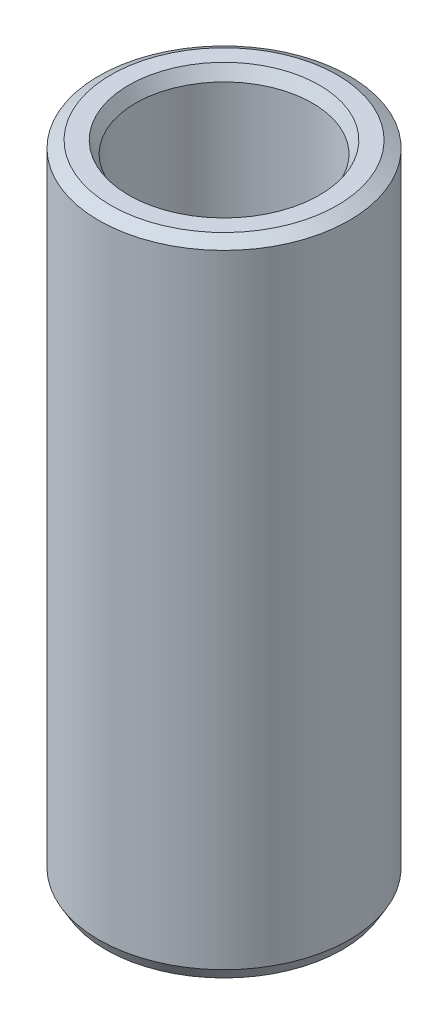
ISO-10303-21;
HEADER;
FILE_DESCRIPTION(('STEP AP214'),'2;1');
FILE_NAME('part.step','',(''),(''),'','','');
FILE_SCHEMA(('AUTOMOTIVE_DESIGN { 1 0 10303 214 1 1 1 1 }'));
ENDSEC;
DATA;
#1=APPLICATION_CONTEXT('core data for automotive mechanical design processes');
#2=APPLICATION_PROTOCOL_DEFINITION('international standard','automotive_design',2000,#1);
#3=PRODUCT_CONTEXT('',#1,'mechanical');
#4=PRODUCT('Part','Part','',(#3));
#5=PRODUCT_RELATED_PRODUCT_CATEGORY('part','',(#4));
#6=PRODUCT_DEFINITION_FORMATION('','',#4);
#7=PRODUCT_DEFINITION_CONTEXT('part definition',#1,'design');
#8=PRODUCT_DEFINITION('design','',#6,#7);
#9=PRODUCT_DEFINITION_SHAPE('','',#8);
#10=(LENGTH_UNIT() NAMED_UNIT(*) SI_UNIT(.MILLI.,.METRE.));
#11=(NAMED_UNIT(*) PLANE_ANGLE_UNIT() SI_UNIT($,.RADIAN.));
#12=(NAMED_UNIT(*) SI_UNIT($,.STERADIAN.) SOLID_ANGLE_UNIT());
#13=UNCERTAINTY_MEASURE_WITH_UNIT(LENGTH_MEASURE(1.E-05),#10,'distance_accuracy_value','');
#14=(GEOMETRIC_REPRESENTATION_CONTEXT(3) GLOBAL_UNCERTAINTY_ASSIGNED_CONTEXT((#13)) GLOBAL_UNIT_ASSIGNED_CONTEXT((#10,
#11,#12)) REPRESENTATION_CONTEXT('',''));
#15=CARTESIAN_POINT('',(0.,0.,0.));
#16=DIRECTION('',(0.,0.,1.));
#17=DIRECTION('',(1.,0.,0.));
#18=AXIS2_PLACEMENT_3D('',#15,#16,#17);
#19=CARTESIAN_POINT('',(0.,230.687205586225,0.));
#20=DIRECTION('',(0.,-1.,0.));
#21=DIRECTION('',(0.,0.,-1.));
#22=AXIS2_PLACEMENT_3D('',#19,#20,#21);
#23=CYLINDRICAL_SURFACE('',#22,45.);
#24=CARTESIAN_POINT('',(0.,4.33862265360732,0.));
#25=DIRECTION('',(0.,1.,0.));
#26=DIRECTION('',(0.,0.,1.));
#27=AXIS2_PLACEMENT_3D('',#24,#25,#26);
#28=CIRCLE('',#27,45.);
#29=CARTESIAN_POINT('',(0.,4.33862265360732,45.));
#30=VERTEX_POINT('',#29);
#31=EDGE_CURVE('E10',#30,#30,#28,.T.);
#32=ORIENTED_EDGE('',*,*,#31,.T.);
#33=EDGE_LOOP('',(#32));
#34=FACE_BOUND('',#33,.T.);
#35=CARTESIAN_POINT('',(0.,228.182300629253,0.));
#36=DIRECTION('',(0.,1.,0.));
#37=DIRECTION('',(0.,0.,1.));
#38=AXIS2_PLACEMENT_3D('',#35,#36,#37);
#39=CIRCLE('',#38,45.);
#40=CARTESIAN_POINT('',(0.,228.182300629253,45.));
#41=VERTEX_POINT('',#40);
#42=EDGE_CURVE('E50',#41,#41,#39,.F.);
#43=ORIENTED_EDGE('',*,*,#42,.T.);
#44=EDGE_LOOP('',(#43));
#45=FACE_BOUND('',#44,.T.);
#46=ADVANCED_FACE('F39',(#34,#45),#23,.T.);
#47=CARTESIAN_POINT('',(0.,230.687205586225,0.));
#48=DIRECTION('',(0.,1.,0.));
#49=DIRECTION('',(0.,0.,1.));
#50=AXIS2_PLACEMENT_3D('',#47,#48,#49);
#51=PLANE('',#50);
#52=CARTESIAN_POINT('',(0.,230.687205586225,0.));
#53=DIRECTION('',(0.,1.,0.));
#54=DIRECTION('',(0.,0.,1.));
#55=AXIS2_PLACEMENT_3D('',#52,#53,#54);
#56=CIRCLE('',#55,34.2647397376942);
#57=CARTESIAN_POINT('',(0.,230.687205586225,34.2647397376942));
#58=VERTEX_POINT('',#57);
#59=EDGE_CURVE('E58',#58,#58,#56,.F.);
#60=ORIENTED_EDGE('',*,*,#59,.T.);
#61=EDGE_LOOP('',(#60));
#62=FACE_BOUND('',#61,.T.);
#63=CARTESIAN_POINT('',(0.,230.687205586225,0.));
#64=DIRECTION('',(0.,1.,0.));
#65=DIRECTION('',(0.,0.,1.));
#66=AXIS2_PLACEMENT_3D('',#63,#64,#65);
#67=CIRCLE('',#66,40.6613773463926);
#68=CARTESIAN_POINT('',(0.,230.687205586225,40.6613773463926));
#69=VERTEX_POINT('',#68);
#70=EDGE_CURVE('E61',#69,#69,#67,.T.);
#71=ORIENTED_EDGE('',*,*,#70,.T.);
#72=EDGE_LOOP('',(#71));
#73=FACE_BOUND('',#72,.T.);
#74=ADVANCED_FACE('F88',(#62,#73),#51,.T.);
#75=CARTESIAN_POINT('',(0.,0.,0.));
#76=DIRECTION('',(0.,1.,0.));
#77=DIRECTION('',(0.,0.,1.));
#78=AXIS2_PLACEMENT_3D('',#75,#76,#77);
#79=PLANE('',#78);
#80=CARTESIAN_POINT('',(0.,0.,0.));
#81=DIRECTION('',(0.,1.,0.));
#82=DIRECTION('',(0.,0.,1.));
#83=AXIS2_PLACEMENT_3D('',#80,#81,#82);
#84=CIRCLE('',#83,36.0984574343291);
#85=CARTESIAN_POINT('',(0.,0.,36.0984574343291));
#86=VERTEX_POINT('',#85);
#87=EDGE_CURVE('E51',#86,#86,#84,.T.);
#88=ORIENTED_EDGE('',*,*,#87,.T.);
#89=EDGE_LOOP('',(#88));
#90=FACE_BOUND('',#89,.T.);
#91=CARTESIAN_POINT('',(0.,0.,0.));
#92=DIRECTION('',(0.,1.,0.));
#93=DIRECTION('',(0.,0.,1.));
#94=AXIS2_PLACEMENT_3D('',#91,#92,#93);
#95=CIRCLE('',#94,42.4950950430276);
#96=CARTESIAN_POINT('',(0.,0.,42.4950950430276));
#97=VERTEX_POINT('',#96);
#98=EDGE_CURVE('E54',#97,#97,#95,.F.);
#99=ORIENTED_EDGE('',*,*,#98,.T.);
#100=EDGE_LOOP('',(#99));
#101=FACE_BOUND('',#100,.T.);
#102=ADVANCED_FACE('F83',(#90,#101),#79,.F.);
#103=CARTESIAN_POINT('',(0.,230.687205586225,0.));
#104=DIRECTION('',(0.,-1.,0.));
#105=DIRECTION('',(0.,0.,-1.));
#106=AXIS2_PLACEMENT_3D('',#103,#104,#105);
#107=CYLINDRICAL_SURFACE('',#106,31.7598347807217);
#108=CARTESIAN_POINT('',(0.,226.348582932618,0.));
#109=DIRECTION('',(0.,1.,0.));
#110=DIRECTION('',(0.,0.,1.));
#111=AXIS2_PLACEMENT_3D('',#108,#109,#110);
#112=CIRCLE('',#111,31.7598347807217);
#113=CARTESIAN_POINT('',(0.,226.348582932618,31.7598347807217));
#114=VERTEX_POINT('',#113);
#115=EDGE_CURVE('E67',#114,#114,#112,.T.);
#116=ORIENTED_EDGE('',*,*,#115,.T.);
#117=EDGE_LOOP('',(#116));
#118=FACE_BOUND('',#117,.T.);
#119=CARTESIAN_POINT('',(0.,2.50490495697245,0.));
#120=DIRECTION('',(0.,1.,0.));
#121=DIRECTION('',(0.,0.,1.));
#122=AXIS2_PLACEMENT_3D('',#119,#120,#121);
#123=CIRCLE('',#122,31.7598347807217);
#124=CARTESIAN_POINT('',(0.,2.50490495697245,31.7598347807217));
#125=VERTEX_POINT('',#124);
#126=EDGE_CURVE('E69',#125,#125,#123,.F.);
#127=ORIENTED_EDGE('',*,*,#126,.T.);
#128=EDGE_LOOP('',(#127));
#129=FACE_BOUND('',#128,.T.);
#130=ADVANCED_FACE('F71',(#118,#129),#107,.F.);
#131=CARTESIAN_POINT('',(0.,226.348582932618,0.));
#132=DIRECTION('',(0.,1.,0.));
#133=DIRECTION('',(0.,0.,1.));
#134=AXIS2_PLACEMENT_3D('',#131,#132,#133);
#135=CONICAL_SURFACE('',#134,31.7598347807217,0.523598775598297);
#136=ORIENTED_EDGE('',*,*,#59,.F.);
#137=EDGE_LOOP('',(#136));
#138=FACE_BOUND('',#137,.T.);
#139=ORIENTED_EDGE('',*,*,#115,.F.);
#140=EDGE_LOOP('',(#139));
#141=FACE_BOUND('',#140,.T.);
#142=ADVANCED_FACE('F77',(#138,#141),#135,.F.);
#143=CARTESIAN_POINT('',(0.,0.,0.));
#144=DIRECTION('',(0.,-1.,0.));
#145=DIRECTION('',(0.,0.,-1.));
#146=AXIS2_PLACEMENT_3D('',#143,#144,#145);
#147=CONICAL_SURFACE('',#146,36.0984574343291,1.04719755119659);
#148=ORIENTED_EDGE('',*,*,#126,.F.);
#149=EDGE_LOOP('',(#148));
#150=FACE_BOUND('',#149,.T.);
#151=ORIENTED_EDGE('',*,*,#87,.F.);
#152=EDGE_LOOP('',(#151));
#153=FACE_BOUND('',#152,.T.);
#154=ADVANCED_FACE('F73',(#150,#153),#147,.F.);
#155=CARTESIAN_POINT('',(0.,4.33862265360732,0.));
#156=DIRECTION('',(0.,1.,0.));
#157=DIRECTION('',(0.,0.,1.));
#158=AXIS2_PLACEMENT_3D('',#155,#156,#157);
#159=CONICAL_SURFACE('',#158,45.,0.523598775598302);
#160=ORIENTED_EDGE('',*,*,#98,.F.);
#161=EDGE_LOOP('',(#160));
#162=FACE_BOUND('',#161,.T.);
#163=ORIENTED_EDGE('',*,*,#31,.F.);
#164=EDGE_LOOP('',(#163));
#165=FACE_BOUND('',#164,.T.);
#166=ADVANCED_FACE('F76',(#162,#165),#159,.T.);
#167=CARTESIAN_POINT('',(0.,230.687205586225,0.));
#168=DIRECTION('',(0.,-1.,0.));
#169=DIRECTION('',(0.,0.,-1.));
#170=AXIS2_PLACEMENT_3D('',#167,#168,#169);
#171=CONICAL_SURFACE('',#170,40.6613773463926,1.0471975511966);
#172=ORIENTED_EDGE('',*,*,#42,.F.);
#173=EDGE_LOOP('',(#172));
#174=FACE_BOUND('',#173,.T.);
#175=ORIENTED_EDGE('',*,*,#70,.F.);
#176=EDGE_LOOP('',(#175));
#177=FACE_BOUND('',#176,.T.);
#178=ADVANCED_FACE('F45',(#174,#177),#171,.T.);
#179=CLOSED_SHELL('',(#46,#74,#102,#130,#142,#154,#166,#178));
#180=MANIFOLD_SOLID_BREP('B2',#179);
#181=ADVANCED_BREP_SHAPE_REPRESENTATION('',(#18,#180),#14);
#182=SHAPE_DEFINITION_REPRESENTATION(#9,#181);
ENDSEC;
END-ISO-10303-21;
